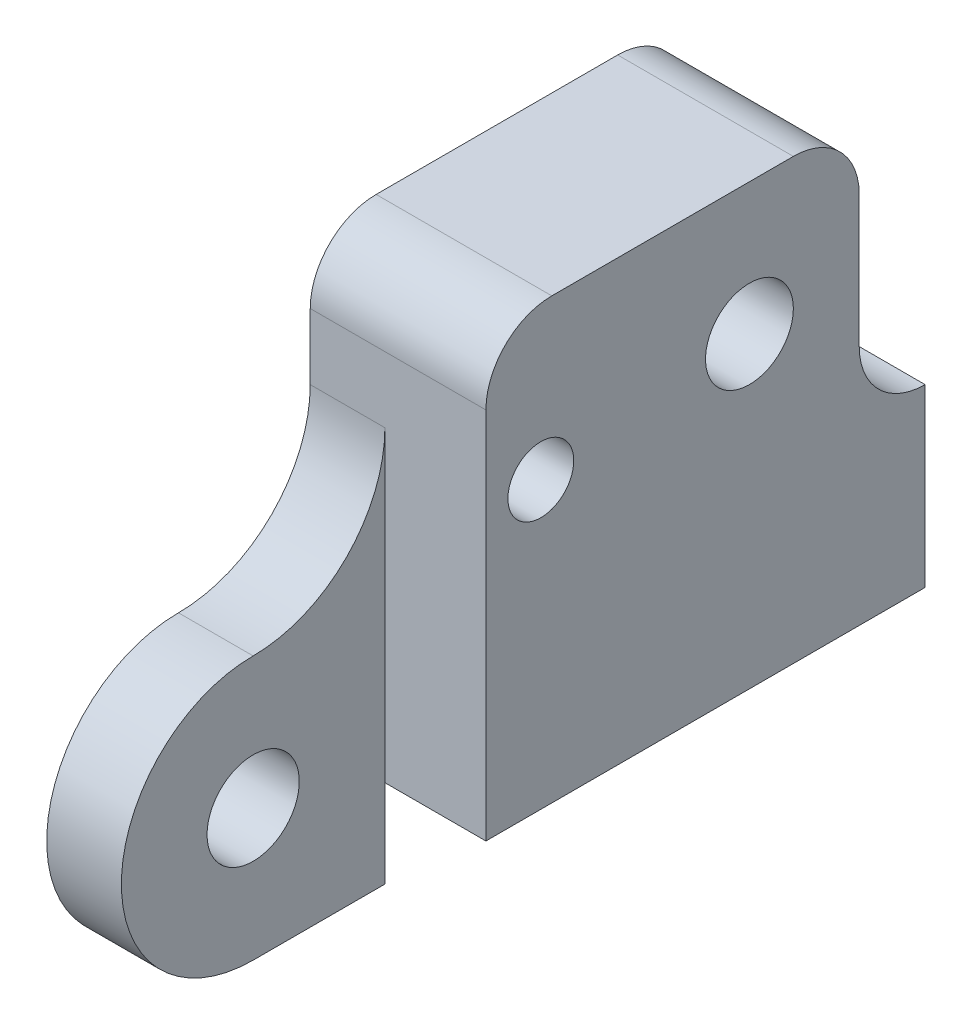
ISO-10303-21;
HEADER;
FILE_DESCRIPTION(('STEP AP214'),'2;1');
FILE_NAME('part.step','',(''),(''),'','','');
FILE_SCHEMA(('AUTOMOTIVE_DESIGN { 1 0 10303 214 1 1 1 1 }'));
ENDSEC;
DATA;
#1=APPLICATION_CONTEXT('core data for automotive mechanical design processes');
#2=APPLICATION_PROTOCOL_DEFINITION('international standard','automotive_design',2000,#1);
#3=PRODUCT_CONTEXT('',#1,'mechanical');
#4=PRODUCT('Part','Part','',(#3));
#5=PRODUCT_RELATED_PRODUCT_CATEGORY('part','',(#4));
#6=PRODUCT_DEFINITION_FORMATION('','',#4);
#7=PRODUCT_DEFINITION_CONTEXT('part definition',#1,'design');
#8=PRODUCT_DEFINITION('design','',#6,#7);
#9=PRODUCT_DEFINITION_SHAPE('','',#8);
#10=(LENGTH_UNIT() NAMED_UNIT(*) SI_UNIT(.MILLI.,.METRE.));
#11=(NAMED_UNIT(*) PLANE_ANGLE_UNIT() SI_UNIT($,.RADIAN.));
#12=(NAMED_UNIT(*) SI_UNIT($,.STERADIAN.) SOLID_ANGLE_UNIT());
#13=UNCERTAINTY_MEASURE_WITH_UNIT(LENGTH_MEASURE(1.E-05),#10,'distance_accuracy_value','');
#14=(GEOMETRIC_REPRESENTATION_CONTEXT(3) GLOBAL_UNCERTAINTY_ASSIGNED_CONTEXT((#13)) GLOBAL_UNIT_ASSIGNED_CONTEXT((#10,
#11,#12)) REPRESENTATION_CONTEXT('',''));
#15=CARTESIAN_POINT('',(0.,0.,0.));
#16=DIRECTION('',(0.,0.,1.));
#17=DIRECTION('',(1.,0.,0.));
#18=AXIS2_PLACEMENT_3D('',#15,#16,#17);
#19=CARTESIAN_POINT('',(8.,6.,0.));
#20=DIRECTION('',(-1.,0.,0.));
#21=DIRECTION('',(0.,0.,1.));
#22=AXIS2_PLACEMENT_3D('',#19,#20,#21);
#23=PLANE('',#22);
#24=CARTESIAN_POINT('',(8.,18.,-18.));
#25=DIRECTION('',(1.,0.,0.));
#26=DIRECTION('',(0.,0.,-1.));
#27=AXIS2_PLACEMENT_3D('',#24,#25,#26);
#28=CIRCLE('',#27,2.00000000000001);
#29=CARTESIAN_POINT('',(8.,18.,-20.));
#30=VERTEX_POINT('',#29);
#31=EDGE_CURVE('E230',#30,#30,#28,.T.);
#32=ORIENTED_EDGE('',*,*,#31,.F.);
#33=EDGE_LOOP('',(#32));
#34=FACE_BOUND('',#33,.T.);
#35=DIRECTION('',(0.,-1.,0.));
#36=VECTOR('',#35,1.);
#37=CARTESIAN_POINT('',(8.,12.,-6.));
#38=LINE('',#37,#36);
#39=CARTESIAN_POINT('',(8.,21.,-6.));
#40=VERTEX_POINT('',#39);
#41=CARTESIAN_POINT('',(8.,4.,-6.));
#42=VERTEX_POINT('',#41);
#43=EDGE_CURVE('E158',#40,#42,#38,.T.);
#44=ORIENTED_EDGE('',*,*,#43,.T.);
#45=DIRECTION('',(0.,0.,-1.));
#46=VECTOR('',#45,1.);
#47=CARTESIAN_POINT('',(8.,4.,-26.));
#48=LINE('',#47,#46);
#49=CARTESIAN_POINT('',(8.,4.,-26.));
#50=VERTEX_POINT('',#49);
#51=EDGE_CURVE('E242',#42,#50,#48,.T.);
#52=ORIENTED_EDGE('',*,*,#51,.T.);
#53=DIRECTION('',(0.,1.,0.));
#54=VECTOR('',#53,1.);
#55=CARTESIAN_POINT('',(8.,12.,-26.));
#56=LINE('',#55,#54);
#57=CARTESIAN_POINT('',(8.,12.,-26.));
#58=VERTEX_POINT('',#57);
#59=EDGE_CURVE('E244',#50,#58,#56,.T.);
#60=ORIENTED_EDGE('',*,*,#59,.T.);
#61=CARTESIAN_POINT('',(8.,15.,-26.));
#62=DIRECTION('',(-1.,0.,0.));
#63=DIRECTION('',(0.,0.,1.));
#64=AXIS2_PLACEMENT_3D('',#61,#62,#63);
#65=CIRCLE('',#64,3.);
#66=CARTESIAN_POINT('',(8.,15.,-23.));
#67=VERTEX_POINT('',#66);
#68=EDGE_CURVE('E198',#58,#67,#65,.T.);
#69=ORIENTED_EDGE('',*,*,#68,.T.);
#70=DIRECTION('',(0.,1.,0.));
#71=VECTOR('',#70,1.);
#72=CARTESIAN_POINT('',(8.,24.,-23.));
#73=LINE('',#72,#71);
#74=CARTESIAN_POINT('',(8.,21.,-23.));
#75=VERTEX_POINT('',#74);
#76=EDGE_CURVE('E246',#67,#75,#73,.T.);
#77=ORIENTED_EDGE('',*,*,#76,.T.);
#78=CARTESIAN_POINT('',(8.,21.,-20.));
#79=DIRECTION('',(-1.,0.,0.));
#80=DIRECTION('',(0.,0.,1.));
#81=AXIS2_PLACEMENT_3D('',#78,#79,#80);
#82=CIRCLE('',#81,3.);
#83=CARTESIAN_POINT('',(8.,24.,-20.));
#84=VERTEX_POINT('',#83);
#85=EDGE_CURVE('E188',#75,#84,#82,.F.);
#86=ORIENTED_EDGE('',*,*,#85,.T.);
#87=DIRECTION('',(0.,0.,1.));
#88=VECTOR('',#87,1.);
#89=CARTESIAN_POINT('',(8.,24.,-6.));
#90=LINE('',#89,#88);
#91=CARTESIAN_POINT('',(8.,24.,-9.));
#92=VERTEX_POINT('',#91);
#93=EDGE_CURVE('E162',#84,#92,#90,.T.);
#94=ORIENTED_EDGE('',*,*,#93,.T.);
#95=CARTESIAN_POINT('',(8.,21.,-9.));
#96=DIRECTION('',(-1.,0.,0.));
#97=DIRECTION('',(0.,0.,1.));
#98=AXIS2_PLACEMENT_3D('',#95,#96,#97);
#99=CIRCLE('',#98,3.);
#100=EDGE_CURVE('E190',#92,#40,#99,.F.);
#101=ORIENTED_EDGE('',*,*,#100,.T.);
#102=EDGE_LOOP('',(#44,#52,#60,#69,#77,#86,#94,#101));
#103=FACE_BOUND('',#102,.T.);
#104=CARTESIAN_POINT('',(8.,17.,-8.5));
#105=DIRECTION('',(1.,0.,0.));
#106=DIRECTION('',(0.,0.,-1.));
#107=AXIS2_PLACEMENT_3D('',#104,#105,#106);
#108=CIRCLE('',#107,1.5);
#109=CARTESIAN_POINT('',(8.,17.,-10.));
#110=VERTEX_POINT('',#109);
#111=EDGE_CURVE('E236',#110,#110,#108,.T.);
#112=ORIENTED_EDGE('',*,*,#111,.F.);
#113=EDGE_LOOP('',(#112));
#114=FACE_BOUND('',#113,.T.);
#115=ADVANCED_FACE('F33',(#34,#103,#114),#23,.F.);
#116=CARTESIAN_POINT('',(0.,6.,0.));
#117=DIRECTION('',(-1.,0.,0.));
#118=DIRECTION('',(0.,0.,1.));
#119=AXIS2_PLACEMENT_3D('',#116,#117,#118);
#120=PLANE('',#119);
#121=CARTESIAN_POINT('',(0.,6.,0.));
#122=DIRECTION('',(-1.,0.,0.));
#123=DIRECTION('',(0.,0.,1.));
#124=AXIS2_PLACEMENT_3D('',#121,#122,#123);
#125=CIRCLE('',#124,2.09999999999999);
#126=CARTESIAN_POINT('',(0.,6.,2.09999999999999));
#127=VERTEX_POINT('',#126);
#128=EDGE_CURVE('E226',#127,#127,#125,.T.);
#129=ORIENTED_EDGE('',*,*,#128,.F.);
#130=EDGE_LOOP('',(#129));
#131=FACE_BOUND('',#130,.T.);
#132=CARTESIAN_POINT('',(0.,17.,-8.5));
#133=DIRECTION('',(1.,0.,0.));
#134=DIRECTION('',(0.,0.,-1.));
#135=AXIS2_PLACEMENT_3D('',#132,#133,#134);
#136=CIRCLE('',#135,1.5);
#137=CARTESIAN_POINT('',(0.,17.,-10.));
#138=VERTEX_POINT('',#137);
#139=EDGE_CURVE('E233',#138,#138,#136,.T.);
#140=ORIENTED_EDGE('',*,*,#139,.T.);
#141=EDGE_LOOP('',(#140));
#142=FACE_BOUND('',#141,.T.);
#143=DIRECTION('',(0.,-1.,0.));
#144=VECTOR('',#143,1.);
#145=CARTESIAN_POINT('',(0.,12.,-6.));
#146=LINE('',#145,#144);
#147=CARTESIAN_POINT('',(0.,21.,-6.));
#148=VERTEX_POINT('',#147);
#149=CARTESIAN_POINT('',(0.,18.,-6.));
#150=VERTEX_POINT('',#149);
#151=EDGE_CURVE('E204',#148,#150,#146,.T.);
#152=ORIENTED_EDGE('',*,*,#151,.F.);
#153=CARTESIAN_POINT('',(0.,21.,-9.));
#154=DIRECTION('',(-1.,0.,0.));
#155=DIRECTION('',(0.,0.,1.));
#156=AXIS2_PLACEMENT_3D('',#153,#154,#155);
#157=CIRCLE('',#156,3.);
#158=CARTESIAN_POINT('',(0.,24.,-9.));
#159=VERTEX_POINT('',#158);
#160=EDGE_CURVE('E181',#148,#159,#157,.T.);
#161=ORIENTED_EDGE('',*,*,#160,.T.);
#162=DIRECTION('',(0.,0.,1.));
#163=VECTOR('',#162,1.);
#164=CARTESIAN_POINT('',(0.,24.,-6.));
#165=LINE('',#164,#163);
#166=CARTESIAN_POINT('',(0.,24.,-20.));
#167=VERTEX_POINT('',#166);
#168=EDGE_CURVE('E258',#167,#159,#165,.T.);
#169=ORIENTED_EDGE('',*,*,#168,.F.);
#170=CARTESIAN_POINT('',(0.,21.,-20.));
#171=DIRECTION('',(-1.,0.,0.));
#172=DIRECTION('',(0.,0.,1.));
#173=AXIS2_PLACEMENT_3D('',#170,#171,#172);
#174=CIRCLE('',#173,3.);
#175=CARTESIAN_POINT('',(0.,21.,-23.));
#176=VERTEX_POINT('',#175);
#177=EDGE_CURVE('E179',#167,#176,#174,.T.);
#178=ORIENTED_EDGE('',*,*,#177,.T.);
#179=DIRECTION('',(0.,1.,0.));
#180=VECTOR('',#179,1.);
#181=CARTESIAN_POINT('',(0.,24.,-23.));
#182=LINE('',#181,#180);
#183=CARTESIAN_POINT('',(0.,15.,-23.));
#184=VERTEX_POINT('',#183);
#185=EDGE_CURVE('E256',#184,#176,#182,.T.);
#186=ORIENTED_EDGE('',*,*,#185,.F.);
#187=CARTESIAN_POINT('',(0.,15.,-26.));
#188=DIRECTION('',(-1.,0.,0.));
#189=DIRECTION('',(0.,0.,1.));
#190=AXIS2_PLACEMENT_3D('',#187,#188,#189);
#191=CIRCLE('',#190,3.);
#192=CARTESIAN_POINT('',(0.,12.,-26.));
#193=VERTEX_POINT('',#192);
#194=EDGE_CURVE('E196',#184,#193,#191,.F.);
#195=ORIENTED_EDGE('',*,*,#194,.T.);
#196=DIRECTION('',(0.,1.,0.));
#197=VECTOR('',#196,1.);
#198=CARTESIAN_POINT('',(0.,12.,-26.));
#199=LINE('',#198,#197);
#200=CARTESIAN_POINT('',(0.,4.,-26.));
#201=VERTEX_POINT('',#200);
#202=EDGE_CURVE('E253',#201,#193,#199,.T.);
#203=ORIENTED_EDGE('',*,*,#202,.F.);
#204=DIRECTION('',(0.,0.,-1.));
#205=VECTOR('',#204,1.);
#206=CARTESIAN_POINT('',(0.,4.,-26.));
#207=LINE('',#206,#205);
#208=CARTESIAN_POINT('',(0.,4.,-6.));
#209=VERTEX_POINT('',#208);
#210=EDGE_CURVE('E251',#209,#201,#207,.T.);
#211=ORIENTED_EDGE('',*,*,#210,.F.);
#212=DIRECTION('',(0.,1.,0.));
#213=VECTOR('',#212,1.);
#214=CARTESIAN_POINT('',(0.,4.,-6.));
#215=LINE('',#214,#213);
#216=CARTESIAN_POINT('',(0.,0.,-6.));
#217=VERTEX_POINT('',#216);
#218=EDGE_CURVE('E239',#217,#209,#215,.T.);
#219=ORIENTED_EDGE('',*,*,#218,.F.);
#220=DIRECTION('',(0.,0.,-1.));
#221=VECTOR('',#220,1.);
#222=CARTESIAN_POINT('',(0.,0.,-6.));
#223=LINE('',#222,#221);
#224=CARTESIAN_POINT('',(0.,0.,0.));
#225=VERTEX_POINT('',#224);
#226=EDGE_CURVE('E155',#225,#217,#223,.T.);
#227=ORIENTED_EDGE('',*,*,#226,.F.);
#228=CARTESIAN_POINT('',(0.,6.,0.));
#229=DIRECTION('',(1.,0.,0.));
#230=DIRECTION('',(0.,0.,1.));
#231=AXIS2_PLACEMENT_3D('',#228,#229,#230);
#232=CIRCLE('',#231,6.);
#233=CARTESIAN_POINT('',(0.,12.,0.));
#234=VERTEX_POINT('',#233);
#235=EDGE_CURVE('E261',#234,#225,#232,.T.);
#236=ORIENTED_EDGE('',*,*,#235,.F.);
#237=CARTESIAN_POINT('',(0.,18.,0.));
#238=DIRECTION('',(-1.,0.,0.));
#239=DIRECTION('',(0.,0.,1.));
#240=AXIS2_PLACEMENT_3D('',#237,#238,#239);
#241=CIRCLE('',#240,6.);
#242=EDGE_CURVE('E11',#234,#150,#241,.F.);
#243=ORIENTED_EDGE('',*,*,#242,.T.);
#244=EDGE_LOOP('',(#152,#161,#169,#178,#186,#195,#203,#211,#219,#227,#236,#243));
#245=FACE_BOUND('',#244,.T.);
#246=CARTESIAN_POINT('',(0.,18.,-18.));
#247=DIRECTION('',(1.,0.,0.));
#248=DIRECTION('',(0.,0.,-1.));
#249=AXIS2_PLACEMENT_3D('',#246,#247,#248);
#250=CIRCLE('',#249,2.00000000000001);
#251=CARTESIAN_POINT('',(0.,18.,-20.));
#252=VERTEX_POINT('',#251);
#253=EDGE_CURVE('E229',#252,#252,#250,.T.);
#254=ORIENTED_EDGE('',*,*,#253,.T.);
#255=EDGE_LOOP('',(#254));
#256=FACE_BOUND('',#255,.T.);
#257=ADVANCED_FACE('F265',(#131,#142,#245,#256),#120,.T.);
#258=CARTESIAN_POINT('',(8.,4.,-6.));
#259=DIRECTION('',(0.,0.,1.));
#260=DIRECTION('',(0.,-1.,0.));
#261=AXIS2_PLACEMENT_3D('',#258,#259,#260);
#262=PLANE('',#261);
#263=DIRECTION('',(-1.,0.,0.));
#264=VECTOR('',#263,1.);
#265=CARTESIAN_POINT('',(8.,4.,-6.));
#266=LINE('',#265,#264);
#267=CARTESIAN_POINT('',(3.4,4.,-6.));
#268=VERTEX_POINT('',#267);
#269=EDGE_CURVE('E149',#268,#209,#266,.T.);
#270=ORIENTED_EDGE('',*,*,#269,.F.);
#271=DIRECTION('',(0.,-1.,0.));
#272=VECTOR('',#271,1.);
#273=CARTESIAN_POINT('',(3.4,24.001,-6.));
#274=LINE('',#273,#272);
#275=CARTESIAN_POINT('',(3.4,0.,-6.));
#276=VERTEX_POINT('',#275);
#277=EDGE_CURVE('E135',#268,#276,#274,.T.);
#278=ORIENTED_EDGE('',*,*,#277,.T.);
#279=DIRECTION('',(-1.,0.,0.));
#280=VECTOR('',#279,1.);
#281=CARTESIAN_POINT('',(8.,0.,-6.));
#282=LINE('',#281,#280);
#283=EDGE_CURVE('E147',#276,#217,#282,.T.);
#284=ORIENTED_EDGE('',*,*,#283,.T.);
#285=ORIENTED_EDGE('',*,*,#218,.T.);
#286=EDGE_LOOP('',(#270,#278,#284,#285));
#287=FACE_BOUND('',#286,.T.);
#288=ADVANCED_FACE('F145',(#287),#262,.F.);
#289=CARTESIAN_POINT('',(8.,4.,-26.));
#290=DIRECTION('',(0.,1.,0.));
#291=DIRECTION('',(0.,0.,1.));
#292=AXIS2_PLACEMENT_3D('',#289,#290,#291);
#293=PLANE('',#292);
#294=CARTESIAN_POINT('',(4.,4.,-10.));
#295=DIRECTION('',(0.,-1.,0.));
#296=DIRECTION('',(0.,0.,-1.));
#297=AXIS2_PLACEMENT_3D('',#294,#295,#296);
#298=CIRCLE('',#297,1.25);
#299=CARTESIAN_POINT('',(4.,4.,-11.25));
#300=VERTEX_POINT('',#299);
#301=EDGE_CURVE('E209',#300,#300,#298,.T.);
#302=ORIENTED_EDGE('',*,*,#301,.F.);
#303=EDGE_LOOP('',(#302));
#304=FACE_BOUND('',#303,.T.);
#305=CARTESIAN_POINT('',(4.,4.,-22.));
#306=DIRECTION('',(0.,-1.,0.));
#307=DIRECTION('',(0.,0.,-1.));
#308=AXIS2_PLACEMENT_3D('',#305,#306,#307);
#309=CIRCLE('',#308,1.25);
#310=CARTESIAN_POINT('',(4.,4.,-23.25));
#311=VERTEX_POINT('',#310);
#312=EDGE_CURVE('E220',#311,#311,#309,.T.);
#313=ORIENTED_EDGE('',*,*,#312,.F.);
#314=EDGE_LOOP('',(#313));
#315=FACE_BOUND('',#314,.T.);
#316=ORIENTED_EDGE('',*,*,#210,.T.);
#317=DIRECTION('',(-1.,0.,0.));
#318=VECTOR('',#317,1.);
#319=CARTESIAN_POINT('',(8.,4.,-26.));
#320=LINE('',#319,#318);
#321=EDGE_CURVE('E171',#50,#201,#320,.T.);
#322=ORIENTED_EDGE('',*,*,#321,.F.);
#323=ORIENTED_EDGE('',*,*,#51,.F.);
#324=EDGE_CURVE('E174',#42,#268,#266,.T.);
#325=ORIENTED_EDGE('',*,*,#324,.T.);
#326=ORIENTED_EDGE('',*,*,#269,.T.);
#327=EDGE_LOOP('',(#316,#322,#323,#325,#326));
#328=FACE_BOUND('',#327,.T.);
#329=ADVANCED_FACE('F271',(#304,#315,#328),#293,.F.);
#330=CARTESIAN_POINT('',(8.,12.,-26.));
#331=DIRECTION('',(0.,0.,1.));
#332=DIRECTION('',(1.,0.,0.));
#333=AXIS2_PLACEMENT_3D('',#330,#331,#332);
#334=PLANE('',#333);
#335=ORIENTED_EDGE('',*,*,#202,.T.);
#336=DIRECTION('',(-1.,0.,0.));
#337=VECTOR('',#336,1.);
#338=CARTESIAN_POINT('',(8.,12.,-26.));
#339=LINE('',#338,#337);
#340=EDGE_CURVE('E168',#58,#193,#339,.T.);
#341=ORIENTED_EDGE('',*,*,#340,.F.);
#342=ORIENTED_EDGE('',*,*,#59,.F.);
#343=ORIENTED_EDGE('',*,*,#321,.T.);
#344=EDGE_LOOP('',(#335,#341,#342,#343));
#345=FACE_BOUND('',#344,.T.);
#346=ADVANCED_FACE('F275',(#345),#334,.F.);
#347=CARTESIAN_POINT('',(8.,24.,-23.));
#348=DIRECTION('',(0.,0.,1.));
#349=DIRECTION('',(1.,0.,0.));
#350=AXIS2_PLACEMENT_3D('',#347,#348,#349);
#351=PLANE('',#350);
#352=ORIENTED_EDGE('',*,*,#185,.T.);
#353=DIRECTION('',(-1.,0.,0.));
#354=VECTOR('',#353,1.);
#355=CARTESIAN_POINT('',(8.,21.,-23.));
#356=LINE('',#355,#354);
#357=EDGE_CURVE('E54',#176,#75,#356,.F.);
#358=ORIENTED_EDGE('',*,*,#357,.T.);
#359=ORIENTED_EDGE('',*,*,#76,.F.);
#360=DIRECTION('',(-1.,0.,0.));
#361=VECTOR('',#360,1.);
#362=CARTESIAN_POINT('',(0.,15.,-23.));
#363=LINE('',#362,#361);
#364=EDGE_CURVE('E192',#67,#184,#363,.T.);
#365=ORIENTED_EDGE('',*,*,#364,.T.);
#366=EDGE_LOOP('',(#352,#358,#359,#365));
#367=FACE_BOUND('',#366,.T.);
#368=ADVANCED_FACE('F295',(#367),#351,.F.);
#369=CARTESIAN_POINT('',(8.,24.,-6.));
#370=DIRECTION('',(0.,-1.,0.));
#371=DIRECTION('',(0.,0.,-1.));
#372=AXIS2_PLACEMENT_3D('',#369,#370,#371);
#373=PLANE('',#372);
#374=ORIENTED_EDGE('',*,*,#168,.T.);
#375=DIRECTION('',(-1.,0.,0.));
#376=VECTOR('',#375,1.);
#377=CARTESIAN_POINT('',(8.,24.,-9.));
#378=LINE('',#377,#376);
#379=EDGE_CURVE('E186',#159,#92,#378,.F.);
#380=ORIENTED_EDGE('',*,*,#379,.T.);
#381=ORIENTED_EDGE('',*,*,#93,.F.);
#382=DIRECTION('',(-1.,0.,0.));
#383=VECTOR('',#382,1.);
#384=CARTESIAN_POINT('',(8.,24.,-20.));
#385=LINE('',#384,#383);
#386=EDGE_CURVE('E183',#84,#167,#385,.T.);
#387=ORIENTED_EDGE('',*,*,#386,.T.);
#388=EDGE_LOOP('',(#374,#380,#381,#387));
#389=FACE_BOUND('',#388,.T.);
#390=ADVANCED_FACE('F288',(#389),#373,.F.);
#391=CARTESIAN_POINT('',(8.,12.,-6.));
#392=DIRECTION('',(0.,0.,-1.));
#393=DIRECTION('',(-1.,0.,0.));
#394=AXIS2_PLACEMENT_3D('',#391,#392,#393);
#395=PLANE('',#394);
#396=ORIENTED_EDGE('',*,*,#151,.T.);
#397=DIRECTION('',(-1.,0.,0.));
#398=VECTOR('',#397,1.);
#399=CARTESIAN_POINT('',(8.,18.,-6.));
#400=LINE('',#399,#398);
#401=CARTESIAN_POINT('',(3.4,18.,-6.));
#402=VERTEX_POINT('',#401);
#403=EDGE_CURVE('E41',#150,#402,#400,.F.);
#404=ORIENTED_EDGE('',*,*,#403,.T.);
#405=EDGE_CURVE('E151',#402,#268,#274,.T.);
#406=ORIENTED_EDGE('',*,*,#405,.T.);
#407=ORIENTED_EDGE('',*,*,#324,.F.);
#408=ORIENTED_EDGE('',*,*,#43,.F.);
#409=DIRECTION('',(-1.,0.,0.));
#410=VECTOR('',#409,1.);
#411=CARTESIAN_POINT('',(8.,21.,-6.));
#412=LINE('',#411,#410);
#413=EDGE_CURVE('E176',#40,#148,#412,.T.);
#414=ORIENTED_EDGE('',*,*,#413,.T.);
#415=EDGE_LOOP('',(#396,#404,#406,#407,#408,#414));
#416=FACE_BOUND('',#415,.T.);
#417=ADVANCED_FACE('F202',(#416),#395,.F.);
#418=CARTESIAN_POINT('',(8.,6.,0.));
#419=DIRECTION('',(-1.,0.,0.));
#420=DIRECTION('',(0.,0.,1.));
#421=AXIS2_PLACEMENT_3D('',#418,#419,#420);
#422=CYLINDRICAL_SURFACE('',#421,6.);
#423=DIRECTION('',(-1.,0.,0.));
#424=VECTOR('',#423,1.);
#425=CARTESIAN_POINT('',(8.,0.,0.));
#426=LINE('',#425,#424);
#427=CARTESIAN_POINT('',(3.4,0.,0.));
#428=VERTEX_POINT('',#427);
#429=EDGE_CURVE('E157',#428,#225,#426,.T.);
#430=ORIENTED_EDGE('',*,*,#429,.F.);
#431=CARTESIAN_POINT('',(3.4,6.,0.));
#432=DIRECTION('',(-1.,0.,0.));
#433=DIRECTION('',(0.,0.,1.));
#434=AXIS2_PLACEMENT_3D('',#431,#432,#433);
#435=CIRCLE('',#434,6.);
#436=CARTESIAN_POINT('',(3.4,12.,0.));
#437=VERTEX_POINT('',#436);
#438=EDGE_CURVE('E138',#437,#428,#435,.F.);
#439=ORIENTED_EDGE('',*,*,#438,.F.);
#440=DIRECTION('',(-1.,0.,0.));
#441=VECTOR('',#440,1.);
#442=CARTESIAN_POINT('',(8.,12.,0.));
#443=LINE('',#442,#441);
#444=EDGE_CURVE('E160',#437,#234,#443,.T.);
#445=ORIENTED_EDGE('',*,*,#444,.T.);
#446=ORIENTED_EDGE('',*,*,#235,.T.);
#447=EDGE_LOOP('',(#430,#439,#445,#446));
#448=FACE_BOUND('',#447,.T.);
#449=ADVANCED_FACE('F264',(#448),#422,.T.);
#450=CARTESIAN_POINT('',(8.,0.,-6.));
#451=DIRECTION('',(0.,1.,0.));
#452=DIRECTION('',(0.,0.,1.));
#453=AXIS2_PLACEMENT_3D('',#450,#451,#452);
#454=PLANE('',#453);
#455=ORIENTED_EDGE('',*,*,#283,.F.);
#456=DIRECTION('',(0.,0.,-1.));
#457=VECTOR('',#456,1.);
#458=CARTESIAN_POINT('',(3.4,0.,6.));
#459=LINE('',#458,#457);
#460=EDGE_CURVE('E132',#428,#276,#459,.T.);
#461=ORIENTED_EDGE('',*,*,#460,.F.);
#462=ORIENTED_EDGE('',*,*,#429,.T.);
#463=ORIENTED_EDGE('',*,*,#226,.T.);
#464=EDGE_LOOP('',(#455,#461,#462,#463));
#465=FACE_BOUND('',#464,.T.);
#466=ADVANCED_FACE('F153',(#465),#454,.F.);
#467=CARTESIAN_POINT('',(8.,17.,-8.5));
#468=DIRECTION('',(-1.,0.,0.));
#469=DIRECTION('',(0.,0.,1.));
#470=AXIS2_PLACEMENT_3D('',#467,#468,#469);
#471=CYLINDRICAL_SURFACE('',#470,1.5);
#472=ORIENTED_EDGE('',*,*,#111,.T.);
#473=EDGE_LOOP('',(#472));
#474=FACE_BOUND('',#473,.T.);
#475=ORIENTED_EDGE('',*,*,#139,.F.);
#476=EDGE_LOOP('',(#475));
#477=FACE_BOUND('',#476,.T.);
#478=ADVANCED_FACE('F316',(#474,#477),#471,.F.);
#479=CARTESIAN_POINT('',(8.,18.,-18.));
#480=DIRECTION('',(-1.,0.,0.));
#481=DIRECTION('',(0.,0.,1.));
#482=AXIS2_PLACEMENT_3D('',#479,#480,#481);
#483=CYLINDRICAL_SURFACE('',#482,2.00000000000001);
#484=ORIENTED_EDGE('',*,*,#31,.T.);
#485=EDGE_LOOP('',(#484));
#486=FACE_BOUND('',#485,.T.);
#487=ORIENTED_EDGE('',*,*,#253,.F.);
#488=EDGE_LOOP('',(#487));
#489=FACE_BOUND('',#488,.T.);
#490=ADVANCED_FACE('F337',(#486,#489),#483,.F.);
#491=CARTESIAN_POINT('',(8.,21.,-9.));
#492=DIRECTION('',(-1.,0.,0.));
#493=DIRECTION('',(0.,0.,1.));
#494=AXIS2_PLACEMENT_3D('',#491,#492,#493);
#495=CYLINDRICAL_SURFACE('',#494,3.);
#496=ORIENTED_EDGE('',*,*,#100,.F.);
#497=ORIENTED_EDGE('',*,*,#379,.F.);
#498=ORIENTED_EDGE('',*,*,#160,.F.);
#499=ORIENTED_EDGE('',*,*,#413,.F.);
#500=EDGE_LOOP('',(#496,#497,#498,#499));
#501=FACE_BOUND('',#500,.T.);
#502=ADVANCED_FACE('F284',(#501),#495,.T.);
#503=CARTESIAN_POINT('',(8.,21.,-20.));
#504=DIRECTION('',(-1.,0.,0.));
#505=DIRECTION('',(0.,0.,1.));
#506=AXIS2_PLACEMENT_3D('',#503,#504,#505);
#507=CYLINDRICAL_SURFACE('',#506,3.);
#508=ORIENTED_EDGE('',*,*,#85,.F.);
#509=ORIENTED_EDGE('',*,*,#357,.F.);
#510=ORIENTED_EDGE('',*,*,#177,.F.);
#511=ORIENTED_EDGE('',*,*,#386,.F.);
#512=EDGE_LOOP('',(#508,#509,#510,#511));
#513=FACE_BOUND('',#512,.T.);
#514=ADVANCED_FACE('F293',(#513),#507,.T.);
#515=CARTESIAN_POINT('',(8.,15.,-26.));
#516=DIRECTION('',(1.,0.,0.));
#517=DIRECTION('',(0.,0.,-1.));
#518=AXIS2_PLACEMENT_3D('',#515,#516,#517);
#519=CYLINDRICAL_SURFACE('',#518,3.);
#520=ORIENTED_EDGE('',*,*,#68,.F.);
#521=ORIENTED_EDGE('',*,*,#340,.T.);
#522=ORIENTED_EDGE('',*,*,#194,.F.);
#523=ORIENTED_EDGE('',*,*,#364,.F.);
#524=EDGE_LOOP('',(#520,#521,#522,#523));
#525=FACE_BOUND('',#524,.T.);
#526=ADVANCED_FACE('F298',(#525),#519,.F.);
#527=CARTESIAN_POINT('',(8.,18.,0.));
#528=DIRECTION('',(1.,0.,0.));
#529=DIRECTION('',(0.,0.,-1.));
#530=AXIS2_PLACEMENT_3D('',#527,#528,#529);
#531=CYLINDRICAL_SURFACE('',#530,6.);
#532=ORIENTED_EDGE('',*,*,#444,.F.);
#533=CARTESIAN_POINT('',(3.4,18.,0.));
#534=DIRECTION('',(-1.,0.,0.));
#535=DIRECTION('',(0.,0.,1.));
#536=AXIS2_PLACEMENT_3D('',#533,#534,#535);
#537=CIRCLE('',#536,6.);
#538=EDGE_CURVE('E208',#402,#437,#537,.T.);
#539=ORIENTED_EDGE('',*,*,#538,.F.);
#540=ORIENTED_EDGE('',*,*,#403,.F.);
#541=ORIENTED_EDGE('',*,*,#242,.F.);
#542=EDGE_LOOP('',(#532,#539,#540,#541));
#543=FACE_BOUND('',#542,.T.);
#544=ADVANCED_FACE('F35',(#543),#531,.F.);
#545=CARTESIAN_POINT('',(8.,6.,0.));
#546=DIRECTION('',(1.,0.,0.));
#547=DIRECTION('',(0.,0.,-1.));
#548=AXIS2_PLACEMENT_3D('',#545,#546,#547);
#549=CYLINDRICAL_SURFACE('',#548,2.09999999999999);
#550=CARTESIAN_POINT('',(3.4,6.,0.));
#551=DIRECTION('',(-1.,0.,0.));
#552=DIRECTION('',(0.,0.,1.));
#553=AXIS2_PLACEMENT_3D('',#550,#551,#552);
#554=CIRCLE('',#553,2.09999999999999);
#555=CARTESIAN_POINT('',(3.4,6.,2.09999999999999));
#556=VERTEX_POINT('',#555);
#557=EDGE_CURVE('E210',#556,#556,#554,.T.);
#558=ORIENTED_EDGE('',*,*,#557,.F.);
#559=EDGE_LOOP('',(#558));
#560=FACE_BOUND('',#559,.T.);
#561=ORIENTED_EDGE('',*,*,#128,.T.);
#562=EDGE_LOOP('',(#561));
#563=FACE_BOUND('',#562,.T.);
#564=ADVANCED_FACE('F304',(#560,#563),#549,.F.);
#565=CARTESIAN_POINT('',(4.,10.,-22.));
#566=DIRECTION('',(0.,-1.,0.));
#567=DIRECTION('',(0.,0.,-1.));
#568=AXIS2_PLACEMENT_3D('',#565,#566,#567);
#569=CONICAL_SURFACE('',#568,1.25,1.02974425867665);
#570=CARTESIAN_POINT('',(4.,10.7510757737845,-22.));
#571=VERTEX_POINT('',#570);
#572=VERTEX_LOOP('',#571);
#573=FACE_BOUND('',#572,.T.);
#574=CARTESIAN_POINT('',(4.,10.,-22.));
#575=DIRECTION('',(0.,-1.,0.));
#576=DIRECTION('',(0.,0.,-1.));
#577=AXIS2_PLACEMENT_3D('',#574,#575,#576);
#578=CIRCLE('',#577,1.25);
#579=CARTESIAN_POINT('',(4.,10.,-23.25));
#580=VERTEX_POINT('',#579);
#581=EDGE_CURVE('E223',#580,#580,#578,.T.);
#582=ORIENTED_EDGE('',*,*,#581,.T.);
#583=EDGE_LOOP('',(#582));
#584=FACE_BOUND('',#583,.T.);
#585=ADVANCED_FACE('F350',(#573,#584),#569,.F.);
#586=CARTESIAN_POINT('',(4.,4.,-22.));
#587=DIRECTION('',(0.,-1.,0.));
#588=DIRECTION('',(0.,0.,-1.));
#589=AXIS2_PLACEMENT_3D('',#586,#587,#588);
#590=CYLINDRICAL_SURFACE('',#589,1.25);
#591=ORIENTED_EDGE('',*,*,#581,.F.);
#592=EDGE_LOOP('',(#591));
#593=FACE_BOUND('',#592,.T.);
#594=ORIENTED_EDGE('',*,*,#312,.T.);
#595=EDGE_LOOP('',(#594));
#596=FACE_BOUND('',#595,.T.);
#597=ADVANCED_FACE('F354',(#593,#596),#590,.F.);
#598=CARTESIAN_POINT('',(4.,10.,-10.));
#599=DIRECTION('',(0.,-1.,0.));
#600=DIRECTION('',(0.,0.,-1.));
#601=AXIS2_PLACEMENT_3D('',#598,#599,#600);
#602=CONICAL_SURFACE('',#601,1.25,1.02974425867665);
#603=CARTESIAN_POINT('',(4.,10.7510757737845,-10.));
#604=VERTEX_POINT('',#603);
#605=VERTEX_LOOP('',#604);
#606=FACE_BOUND('',#605,.T.);
#607=CARTESIAN_POINT('',(4.,10.,-10.));
#608=DIRECTION('',(0.,-1.,0.));
#609=DIRECTION('',(0.,0.,-1.));
#610=AXIS2_PLACEMENT_3D('',#607,#608,#609);
#611=CIRCLE('',#610,1.25);
#612=CARTESIAN_POINT('',(4.,10.,-11.25));
#613=VERTEX_POINT('',#612);
#614=EDGE_CURVE('E213',#613,#613,#611,.T.);
#615=ORIENTED_EDGE('',*,*,#614,.T.);
#616=EDGE_LOOP('',(#615));
#617=FACE_BOUND('',#616,.T.);
#618=ADVANCED_FACE('F358',(#606,#617),#602,.F.);
#619=CARTESIAN_POINT('',(4.,4.,-10.));
#620=DIRECTION('',(0.,-1.,0.));
#621=DIRECTION('',(0.,0.,-1.));
#622=AXIS2_PLACEMENT_3D('',#619,#620,#621);
#623=CYLINDRICAL_SURFACE('',#622,1.25);
#624=ORIENTED_EDGE('',*,*,#614,.F.);
#625=EDGE_LOOP('',(#624));
#626=FACE_BOUND('',#625,.T.);
#627=ORIENTED_EDGE('',*,*,#301,.T.);
#628=EDGE_LOOP('',(#627));
#629=FACE_BOUND('',#628,.T.);
#630=ADVANCED_FACE('F362',(#626,#629),#623,.F.);
#631=CARTESIAN_POINT('',(3.4,24.001,6.));
#632=DIRECTION('',(-1.,0.,0.));
#633=DIRECTION('',(0.,0.,1.));
#634=AXIS2_PLACEMENT_3D('',#631,#632,#633);
#635=PLANE('',#634);
#636=ORIENTED_EDGE('',*,*,#557,.T.);
#637=EDGE_LOOP('',(#636));
#638=FACE_BOUND('',#637,.T.);
#639=ORIENTED_EDGE('',*,*,#438,.T.);
#640=ORIENTED_EDGE('',*,*,#460,.T.);
#641=ORIENTED_EDGE('',*,*,#277,.F.);
#642=ORIENTED_EDGE('',*,*,#405,.F.);
#643=ORIENTED_EDGE('',*,*,#538,.T.);
#644=EDGE_LOOP('',(#639,#640,#641,#642,#643));
#645=FACE_BOUND('',#644,.T.);
#646=ADVANCED_FACE('F134',(#638,#645),#635,.F.);
#647=CLOSED_SHELL('',(#115,#257,#288,#329,#346,#368,#390,#417,#449,#466,#478,#490,#502,#514,
#526,#544,#564,#585,#597,#618,#630,#646));
#648=MANIFOLD_SOLID_BREP('B2',#647);
#649=ADVANCED_BREP_SHAPE_REPRESENTATION('',(#18,#648),#14);
#650=SHAPE_DEFINITION_REPRESENTATION(#9,#649);
ENDSEC;
END-ISO-10303-21;
